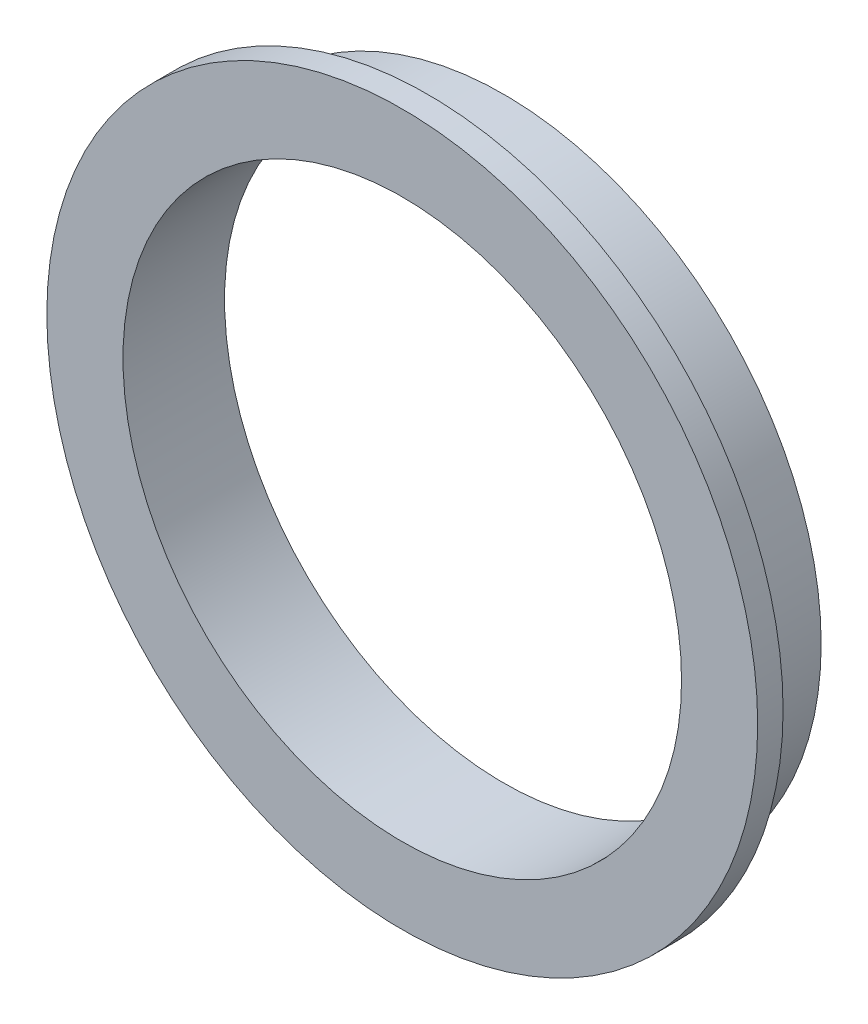
ISO-10303-21;
HEADER;
FILE_DESCRIPTION(('STEP AP214'),'2;1');
FILE_NAME('part.step','',(''),(''),'','','');
FILE_SCHEMA(('AUTOMOTIVE_DESIGN { 1 0 10303 214 1 1 1 1 }'));
ENDSEC;
DATA;
#1=APPLICATION_CONTEXT('core data for automotive mechanical design processes');
#2=APPLICATION_PROTOCOL_DEFINITION('international standard','automotive_design',2000,#1);
#3=PRODUCT_CONTEXT('',#1,'mechanical');
#4=PRODUCT('Part','Part','',(#3));
#5=PRODUCT_RELATED_PRODUCT_CATEGORY('part','',(#4));
#6=PRODUCT_DEFINITION_FORMATION('','',#4);
#7=PRODUCT_DEFINITION_CONTEXT('part definition',#1,'design');
#8=PRODUCT_DEFINITION('design','',#6,#7);
#9=PRODUCT_DEFINITION_SHAPE('','',#8);
#10=(LENGTH_UNIT() NAMED_UNIT(*) SI_UNIT(.MILLI.,.METRE.));
#11=(NAMED_UNIT(*) PLANE_ANGLE_UNIT() SI_UNIT($,.RADIAN.));
#12=(NAMED_UNIT(*) SI_UNIT($,.STERADIAN.) SOLID_ANGLE_UNIT());
#13=UNCERTAINTY_MEASURE_WITH_UNIT(LENGTH_MEASURE(1.E-05),#10,'distance_accuracy_value','');
#14=(GEOMETRIC_REPRESENTATION_CONTEXT(3) GLOBAL_UNCERTAINTY_ASSIGNED_CONTEXT((#13)) GLOBAL_UNIT_ASSIGNED_CONTEXT((#10,
#11,#12)) REPRESENTATION_CONTEXT('',''));
#15=CARTESIAN_POINT('',(0.,0.,0.));
#16=DIRECTION('',(0.,0.,1.));
#17=DIRECTION('',(1.,0.,0.));
#18=AXIS2_PLACEMENT_3D('',#15,#16,#17);
#19=CARTESIAN_POINT('',(0.,69.85,0.));
#20=DIRECTION('',(0.,0.,-1.));
#21=DIRECTION('',(-1.,0.,0.));
#22=AXIS2_PLACEMENT_3D('',#19,#20,#21);
#23=PLANE('',#22);
#24=CARTESIAN_POINT('',(0.,0.,0.));
#25=DIRECTION('',(0.,0.,1.));
#26=DIRECTION('',(1.,0.,0.));
#27=AXIS2_PLACEMENT_3D('',#24,#25,#26);
#28=CIRCLE('',#27,69.85);
#29=CARTESIAN_POINT('',(69.85,0.,0.));
#30=VERTEX_POINT('',#29);
#31=EDGE_CURVE('E64',#30,#30,#28,.T.);
#32=ORIENTED_EDGE('',*,*,#31,.F.);
#33=EDGE_LOOP('',(#32));
#34=FACE_BOUND('',#33,.T.);
#35=CARTESIAN_POINT('',(0.,0.,0.));
#36=DIRECTION('',(0.,0.,1.));
#37=DIRECTION('',(1.,0.,0.));
#38=AXIS2_PLACEMENT_3D('',#35,#36,#37);
#39=CIRCLE('',#38,88.9);
#40=CARTESIAN_POINT('',(88.9,0.,0.));
#41=VERTEX_POINT('',#40);
#42=EDGE_CURVE('E10',#41,#41,#39,.T.);
#43=ORIENTED_EDGE('',*,*,#42,.T.);
#44=EDGE_LOOP('',(#43));
#45=FACE_BOUND('',#44,.T.);
#46=ADVANCED_FACE('F30',(#34,#45),#23,.F.);
#47=CARTESIAN_POINT('',(0.,0.,0.));
#48=DIRECTION('',(0.,0.,1.));
#49=DIRECTION('',(1.,0.,0.));
#50=AXIS2_PLACEMENT_3D('',#47,#48,#49);
#51=CYLINDRICAL_SURFACE('',#50,88.9);
#52=ORIENTED_EDGE('',*,*,#42,.F.);
#53=EDGE_LOOP('',(#52));
#54=FACE_BOUND('',#53,.T.);
#55=CARTESIAN_POINT('',(0.,0.,-6.35));
#56=DIRECTION('',(0.,0.,1.));
#57=DIRECTION('',(1.,0.,0.));
#58=AXIS2_PLACEMENT_3D('',#55,#56,#57);
#59=CIRCLE('',#58,88.9);
#60=CARTESIAN_POINT('',(88.9,0.,-6.35));
#61=VERTEX_POINT('',#60);
#62=EDGE_CURVE('E36',#61,#61,#59,.T.);
#63=ORIENTED_EDGE('',*,*,#62,.T.);
#64=EDGE_LOOP('',(#63));
#65=FACE_BOUND('',#64,.T.);
#66=ADVANCED_FACE('F71',(#54,#65),#51,.T.);
#67=CARTESIAN_POINT('',(0.,88.9,-6.35));
#68=DIRECTION('',(0.,0.,1.));
#69=DIRECTION('',(1.,0.,0.));
#70=AXIS2_PLACEMENT_3D('',#67,#68,#69);
#71=PLANE('',#70);
#72=ORIENTED_EDGE('',*,*,#62,.F.);
#73=EDGE_LOOP('',(#72));
#74=FACE_BOUND('',#73,.T.);
#75=CARTESIAN_POINT('',(0.,0.,-6.35));
#76=DIRECTION('',(0.,0.,1.));
#77=DIRECTION('',(1.,0.,0.));
#78=AXIS2_PLACEMENT_3D('',#75,#76,#77);
#79=CIRCLE('',#78,79.375);
#80=CARTESIAN_POINT('',(79.375,0.,-6.35));
#81=VERTEX_POINT('',#80);
#82=EDGE_CURVE('E40',#81,#81,#79,.T.);
#83=ORIENTED_EDGE('',*,*,#82,.T.);
#84=EDGE_LOOP('',(#83));
#85=FACE_BOUND('',#84,.T.);
#86=ADVANCED_FACE('F75',(#74,#85),#71,.F.);
#87=CARTESIAN_POINT('',(0.,0.,0.));
#88=DIRECTION('',(0.,0.,1.));
#89=DIRECTION('',(1.,0.,0.));
#90=AXIS2_PLACEMENT_3D('',#87,#88,#89);
#91=CYLINDRICAL_SURFACE('',#90,79.375);
#92=ORIENTED_EDGE('',*,*,#82,.F.);
#93=EDGE_LOOP('',(#92));
#94=FACE_BOUND('',#93,.T.);
#95=CARTESIAN_POINT('',(0.,0.,-25.4));
#96=DIRECTION('',(0.,0.,1.));
#97=DIRECTION('',(1.,0.,0.));
#98=AXIS2_PLACEMENT_3D('',#95,#96,#97);
#99=CIRCLE('',#98,79.375);
#100=CARTESIAN_POINT('',(79.375,0.,-25.4));
#101=VERTEX_POINT('',#100);
#102=EDGE_CURVE('E44',#101,#101,#99,.T.);
#103=ORIENTED_EDGE('',*,*,#102,.T.);
#104=EDGE_LOOP('',(#103));
#105=FACE_BOUND('',#104,.T.);
#106=ADVANCED_FACE('F80',(#94,#105),#91,.T.);
#107=CARTESIAN_POINT('',(0.,79.375,-25.4));
#108=DIRECTION('',(0.,0.,1.));
#109=DIRECTION('',(1.,0.,0.));
#110=AXIS2_PLACEMENT_3D('',#107,#108,#109);
#111=PLANE('',#110);
#112=ORIENTED_EDGE('',*,*,#102,.F.);
#113=EDGE_LOOP('',(#112));
#114=FACE_BOUND('',#113,.T.);
#115=CARTESIAN_POINT('',(0.,0.,-25.4));
#116=DIRECTION('',(0.,0.,1.));
#117=DIRECTION('',(1.,0.,0.));
#118=AXIS2_PLACEMENT_3D('',#115,#116,#117);
#119=CIRCLE('',#118,76.2);
#120=CARTESIAN_POINT('',(76.2,0.,-25.4));
#121=VERTEX_POINT('',#120);
#122=EDGE_CURVE('E49',#121,#121,#119,.T.);
#123=ORIENTED_EDGE('',*,*,#122,.T.);
#124=EDGE_LOOP('',(#123));
#125=FACE_BOUND('',#124,.T.);
#126=ADVANCED_FACE('F86',(#114,#125),#111,.F.);
#127=CARTESIAN_POINT('',(0.,0.,0.));
#128=DIRECTION('',(0.,0.,1.));
#129=DIRECTION('',(1.,0.,0.));
#130=AXIS2_PLACEMENT_3D('',#127,#128,#129);
#131=CYLINDRICAL_SURFACE('',#130,76.2);
#132=ORIENTED_EDGE('',*,*,#122,.F.);
#133=EDGE_LOOP('',(#132));
#134=FACE_BOUND('',#133,.T.);
#135=CARTESIAN_POINT('',(0.,0.,-3.175));
#136=DIRECTION('',(0.,0.,1.));
#137=DIRECTION('',(1.,0.,0.));
#138=AXIS2_PLACEMENT_3D('',#135,#136,#137);
#139=CIRCLE('',#138,76.2);
#140=CARTESIAN_POINT('',(76.2,0.,-3.175));
#141=VERTEX_POINT('',#140);
#142=EDGE_CURVE('E52',#141,#141,#139,.T.);
#143=ORIENTED_EDGE('',*,*,#142,.T.);
#144=EDGE_LOOP('',(#143));
#145=FACE_BOUND('',#144,.T.);
#146=ADVANCED_FACE('F90',(#134,#145),#131,.F.);
#147=CARTESIAN_POINT('',(0.,76.2,-3.175));
#148=DIRECTION('',(0.,0.,1.));
#149=DIRECTION('',(1.,0.,0.));
#150=AXIS2_PLACEMENT_3D('',#147,#148,#149);
#151=PLANE('',#150);
#152=ORIENTED_EDGE('',*,*,#142,.F.);
#153=EDGE_LOOP('',(#152));
#154=FACE_BOUND('',#153,.T.);
#155=CARTESIAN_POINT('',(0.,0.,-3.175));
#156=DIRECTION('',(0.,0.,1.));
#157=DIRECTION('',(1.,0.,0.));
#158=AXIS2_PLACEMENT_3D('',#155,#156,#157);
#159=CIRCLE('',#158,73.025);
#160=CARTESIAN_POINT('',(73.025,0.,-3.175));
#161=VERTEX_POINT('',#160);
#162=EDGE_CURVE('E55',#161,#161,#159,.T.);
#163=ORIENTED_EDGE('',*,*,#162,.T.);
#164=EDGE_LOOP('',(#163));
#165=FACE_BOUND('',#164,.T.);
#166=ADVANCED_FACE('F94',(#154,#165),#151,.F.);
#167=CARTESIAN_POINT('',(0.,0.,0.));
#168=DIRECTION('',(0.,0.,1.));
#169=DIRECTION('',(1.,0.,0.));
#170=AXIS2_PLACEMENT_3D('',#167,#168,#169);
#171=CYLINDRICAL_SURFACE('',#170,73.025);
#172=ORIENTED_EDGE('',*,*,#162,.F.);
#173=EDGE_LOOP('',(#172));
#174=FACE_BOUND('',#173,.T.);
#175=CARTESIAN_POINT('',(0.,0.,-25.4));
#176=DIRECTION('',(0.,0.,1.));
#177=DIRECTION('',(1.,0.,0.));
#178=AXIS2_PLACEMENT_3D('',#175,#176,#177);
#179=CIRCLE('',#178,73.025);
#180=CARTESIAN_POINT('',(73.025,0.,-25.4));
#181=VERTEX_POINT('',#180);
#182=EDGE_CURVE('E58',#181,#181,#179,.T.);
#183=ORIENTED_EDGE('',*,*,#182,.T.);
#184=EDGE_LOOP('',(#183));
#185=FACE_BOUND('',#184,.T.);
#186=ADVANCED_FACE('F98',(#174,#185),#171,.T.);
#187=CARTESIAN_POINT('',(0.,73.025,-25.4));
#188=DIRECTION('',(0.,0.,1.));
#189=DIRECTION('',(1.,0.,0.));
#190=AXIS2_PLACEMENT_3D('',#187,#188,#189);
#191=PLANE('',#190);
#192=ORIENTED_EDGE('',*,*,#182,.F.);
#193=EDGE_LOOP('',(#192));
#194=FACE_BOUND('',#193,.T.);
#195=CARTESIAN_POINT('',(0.,0.,-25.4));
#196=DIRECTION('',(0.,0.,1.));
#197=DIRECTION('',(1.,0.,0.));
#198=AXIS2_PLACEMENT_3D('',#195,#196,#197);
#199=CIRCLE('',#198,69.85);
#200=CARTESIAN_POINT('',(69.85,0.,-25.4));
#201=VERTEX_POINT('',#200);
#202=EDGE_CURVE('E61',#201,#201,#199,.T.);
#203=ORIENTED_EDGE('',*,*,#202,.T.);
#204=EDGE_LOOP('',(#203));
#205=FACE_BOUND('',#204,.T.);
#206=ADVANCED_FACE('F102',(#194,#205),#191,.F.);
#207=CARTESIAN_POINT('',(0.,0.,0.));
#208=DIRECTION('',(0.,0.,1.));
#209=DIRECTION('',(1.,0.,0.));
#210=AXIS2_PLACEMENT_3D('',#207,#208,#209);
#211=CYLINDRICAL_SURFACE('',#210,69.85);
#212=ORIENTED_EDGE('',*,*,#202,.F.);
#213=EDGE_LOOP('',(#212));
#214=FACE_BOUND('',#213,.T.);
#215=ORIENTED_EDGE('',*,*,#31,.T.);
#216=EDGE_LOOP('',(#215));
#217=FACE_BOUND('',#216,.T.);
#218=ADVANCED_FACE('F68',(#214,#217),#211,.F.);
#219=CLOSED_SHELL('',(#46,#66,#86,#106,#126,#146,#166,#186,#206,#218));
#220=MANIFOLD_SOLID_BREP('B2',#219);
#221=ADVANCED_BREP_SHAPE_REPRESENTATION('',(#18,#220),#14);
#222=SHAPE_DEFINITION_REPRESENTATION(#9,#221);
ENDSEC;
END-ISO-10303-21;
